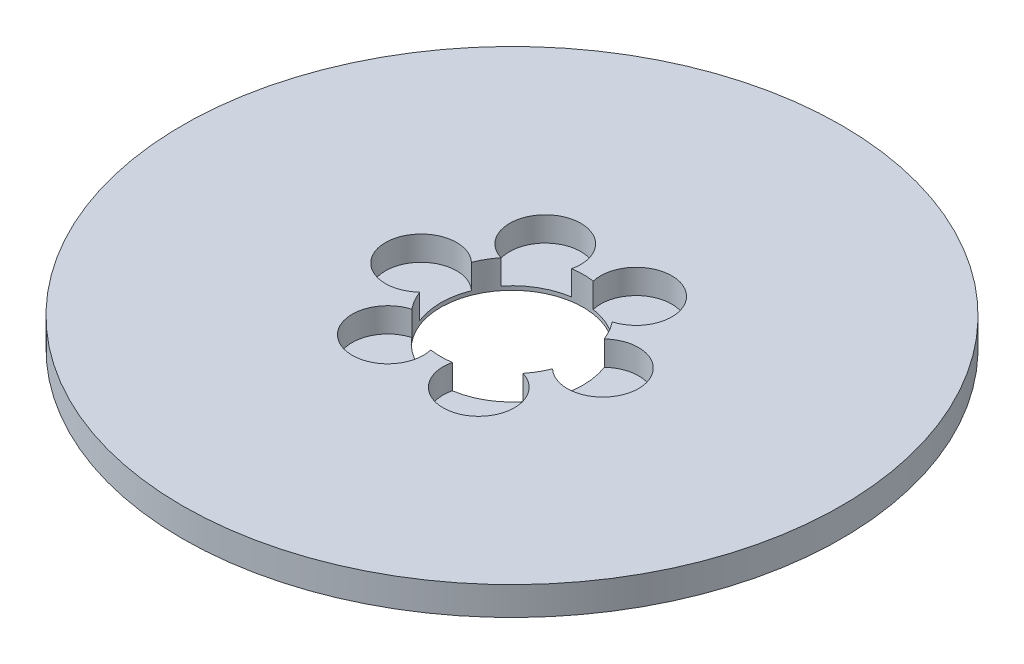
ISO-10303-21;
HEADER;
FILE_DESCRIPTION(('STEP AP214'),'2;1');
FILE_NAME('part.step','',(''),(''),'','','');
FILE_SCHEMA(('AUTOMOTIVE_DESIGN { 1 0 10303 214 1 1 1 1 }'));
ENDSEC;
DATA;
#1=APPLICATION_CONTEXT('core data for automotive mechanical design processes');
#2=APPLICATION_PROTOCOL_DEFINITION('international standard','automotive_design',2000,#1);
#3=PRODUCT_CONTEXT('',#1,'mechanical');
#4=PRODUCT('Part','Part','',(#3));
#5=PRODUCT_RELATED_PRODUCT_CATEGORY('part','',(#4));
#6=PRODUCT_DEFINITION_FORMATION('','',#4);
#7=PRODUCT_DEFINITION_CONTEXT('part definition',#1,'design');
#8=PRODUCT_DEFINITION('design','',#6,#7);
#9=PRODUCT_DEFINITION_SHAPE('','',#8);
#10=(LENGTH_UNIT() NAMED_UNIT(*) SI_UNIT(.MILLI.,.METRE.));
#11=(NAMED_UNIT(*) PLANE_ANGLE_UNIT() SI_UNIT($,.RADIAN.));
#12=(NAMED_UNIT(*) SI_UNIT($,.STERADIAN.) SOLID_ANGLE_UNIT());
#13=UNCERTAINTY_MEASURE_WITH_UNIT(LENGTH_MEASURE(1.E-05),#10,'distance_accuracy_value','');
#14=(GEOMETRIC_REPRESENTATION_CONTEXT(3) GLOBAL_UNCERTAINTY_ASSIGNED_CONTEXT((#13)) GLOBAL_UNIT_ASSIGNED_CONTEXT((#10,
#11,#12)) REPRESENTATION_CONTEXT('',''));
#15=CARTESIAN_POINT('',(0.,0.,0.));
#16=DIRECTION('',(0.,0.,1.));
#17=DIRECTION('',(1.,0.,0.));
#18=AXIS2_PLACEMENT_3D('',#15,#16,#17);
#19=CARTESIAN_POINT('',(0.,8.,0.));
#20=DIRECTION('',(0.,-1.,0.));
#21=DIRECTION('',(0.,0.,-1.));
#22=AXIS2_PLACEMENT_3D('',#19,#20,#21);
#23=CYLINDRICAL_SURFACE('',#22,92.5);
#24=CARTESIAN_POINT('',(0.,8.,0.));
#25=DIRECTION('',(0.,1.,0.));
#26=DIRECTION('',(0.,0.,1.));
#27=AXIS2_PLACEMENT_3D('',#24,#25,#26);
#28=CIRCLE('',#27,92.5);
#29=CARTESIAN_POINT('',(0.,8.,92.5));
#30=VERTEX_POINT('',#29);
#31=EDGE_CURVE('E171',#30,#30,#28,.T.);
#32=ORIENTED_EDGE('',*,*,#31,.F.);
#33=EDGE_LOOP('',(#32));
#34=FACE_BOUND('',#33,.T.);
#35=CARTESIAN_POINT('',(0.,0.,0.));
#36=DIRECTION('',(0.,1.,0.));
#37=DIRECTION('',(0.,0.,1.));
#38=AXIS2_PLACEMENT_3D('',#35,#36,#37);
#39=CIRCLE('',#38,92.5);
#40=CARTESIAN_POINT('',(0.,0.,92.5));
#41=VERTEX_POINT('',#40);
#42=EDGE_CURVE('E157',#41,#41,#39,.T.);
#43=ORIENTED_EDGE('',*,*,#42,.T.);
#44=EDGE_LOOP('',(#43));
#45=FACE_BOUND('',#44,.T.);
#46=ADVANCED_FACE('F39',(#34,#45),#23,.T.);
#47=CARTESIAN_POINT('',(0.,8.,0.));
#48=DIRECTION('',(0.,1.,0.));
#49=DIRECTION('',(0.,0.,1.));
#50=AXIS2_PLACEMENT_3D('',#47,#48,#49);
#51=PLANE('',#50);
#52=CARTESIAN_POINT('',(-12.7580548929387,8.,-22.0975992803219));
#53=DIRECTION('',(0.,1.,0.));
#54=DIRECTION('',(-0.866025403784433,0.,0.50000000000001));
#55=AXIS2_PLACEMENT_3D('',#52,#53,#54);
#56=CIRCLE('',#55,10.);
#57=CARTESIAN_POINT('',(-3.03302849575421,8.,-19.768680738581));
#58=VERTEX_POINT('',#57);
#59=CARTESIAN_POINT('',(-15.6036654710384,8.,-12.5110200970154));
#60=VERTEX_POINT('',#59);
#61=EDGE_CURVE('E214',#58,#60,#56,.T.);
#62=ORIENTED_EDGE('',*,*,#61,.F.);
#63=CARTESIAN_POINT('',(0.,8.,0.));
#64=DIRECTION('',(0.,1.,0.));
#65=DIRECTION('',(0.,0.,1.));
#66=AXIS2_PLACEMENT_3D('',#63,#64,#65);
#67=CIRCLE('',#66,20.);
#68=CARTESIAN_POINT('',(3.0330284957538,8.,-19.7686807385811));
#69=VERTEX_POINT('',#68);
#70=EDGE_CURVE('E272',#69,#58,#67,.T.);
#71=ORIENTED_EDGE('',*,*,#70,.F.);
#72=CARTESIAN_POINT('',(12.7580548929382,8.,-22.0975992803222));
#73=DIRECTION('',(0.,1.,0.));
#74=DIRECTION('',(-0.866025403784443,0.,-0.499999999999992));
#75=AXIS2_PLACEMENT_3D('',#72,#73,#74);
#76=CIRCLE('',#75,10.);
#77=CARTESIAN_POINT('',(15.6036654710382,8.,-12.5110200970157));
#78=VERTEX_POINT('',#77);
#79=EDGE_CURVE('E285',#78,#69,#76,.T.);
#80=ORIENTED_EDGE('',*,*,#79,.F.);
#81=CARTESIAN_POINT('',(18.6366939667923,8.,-7.25766064156546));
#82=VERTEX_POINT('',#81);
#83=EDGE_CURVE('E165',#82,#78,#67,.T.);
#84=ORIENTED_EDGE('',*,*,#83,.F.);
#85=CARTESIAN_POINT('',(25.5161097858769,8.,0.));
#86=DIRECTION('',(0.,1.,0.));
#87=DIRECTION('',(0.,0.,-1.));
#88=AXIS2_PLACEMENT_3D('',#85,#86,#87);
#89=CIRCLE('',#88,10.);
#90=CARTESIAN_POINT('',(18.6366939667923,8.,7.25766064156546));
#91=VERTEX_POINT('',#90);
#92=EDGE_CURVE('E281',#91,#82,#89,.T.);
#93=ORIENTED_EDGE('',*,*,#92,.F.);
#94=CARTESIAN_POINT('',(15.6036654710384,8.,12.5110200970155));
#95=VERTEX_POINT('',#94);
#96=EDGE_CURVE('E160',#95,#91,#67,.T.);
#97=ORIENTED_EDGE('',*,*,#96,.F.);
#98=CARTESIAN_POINT('',(12.7580548929385,8.,22.097599280322));
#99=DIRECTION('',(0.,1.,0.));
#100=DIRECTION('',(0.866025403784436,0.,-0.500000000000004));
#101=AXIS2_PLACEMENT_3D('',#98,#99,#100);
#102=CIRCLE('',#101,10.);
#103=CARTESIAN_POINT('',(3.03302849575407,8.,19.768680738581));
#104=VERTEX_POINT('',#103);
#105=EDGE_CURVE('E154',#104,#95,#102,.T.);
#106=ORIENTED_EDGE('',*,*,#105,.F.);
#107=CARTESIAN_POINT('',(-3.03302849575393,8.,19.768680738581));
#108=VERTEX_POINT('',#107);
#109=EDGE_CURVE('E150',#108,#104,#67,.T.);
#110=ORIENTED_EDGE('',*,*,#109,.F.);
#111=CARTESIAN_POINT('',(-12.7580548929384,8.,22.0975992803221));
#112=DIRECTION('',(0.,1.,0.));
#113=DIRECTION('',(0.86602540378444,0.,0.499999999999998));
#114=AXIS2_PLACEMENT_3D('',#111,#112,#113);
#115=CIRCLE('',#114,10.);
#116=CARTESIAN_POINT('',(-15.6036654710383,8.,12.5110200970156));
#117=VERTEX_POINT('',#116);
#118=EDGE_CURVE('E127',#117,#108,#115,.T.);
#119=ORIENTED_EDGE('',*,*,#118,.F.);
#120=CARTESIAN_POINT('',(-18.6366939667923,8.,7.25766064156546));
#121=VERTEX_POINT('',#120);
#122=EDGE_CURVE('E156',#121,#117,#67,.T.);
#123=ORIENTED_EDGE('',*,*,#122,.F.);
#124=CARTESIAN_POINT('',(-25.5161097858769,8.,0.));
#125=DIRECTION('',(0.,1.,0.));
#126=DIRECTION('',(0.,0.,1.));
#127=AXIS2_PLACEMENT_3D('',#124,#125,#126);
#128=CIRCLE('',#127,10.);
#129=CARTESIAN_POINT('',(-18.6366939667923,8.,-7.25766064156546));
#130=VERTEX_POINT('',#129);
#131=EDGE_CURVE('E164',#130,#121,#128,.T.);
#132=ORIENTED_EDGE('',*,*,#131,.F.);
#133=EDGE_CURVE('E159',#60,#130,#67,.T.);
#134=ORIENTED_EDGE('',*,*,#133,.F.);
#135=EDGE_LOOP('',(#62,#71,#80,#84,#93,#97,#106,#110,#119,#123,#132,#134));
#136=FACE_BOUND('',#135,.T.);
#137=ORIENTED_EDGE('',*,*,#31,.T.);
#138=EDGE_LOOP('',(#137));
#139=FACE_BOUND('',#138,.T.);
#140=ADVANCED_FACE('F155',(#136,#139),#51,.T.);
#141=CARTESIAN_POINT('',(0.,0.,0.));
#142=DIRECTION('',(0.,1.,0.));
#143=DIRECTION('',(0.,0.,1.));
#144=AXIS2_PLACEMENT_3D('',#141,#142,#143);
#145=PLANE('',#144);
#146=CARTESIAN_POINT('',(0.,0.,0.));
#147=DIRECTION('',(0.,1.,0.));
#148=DIRECTION('',(0.,0.,1.));
#149=AXIS2_PLACEMENT_3D('',#146,#147,#148);
#150=CIRCLE('',#149,20.);
#151=CARTESIAN_POINT('',(0.,0.,20.));
#152=VERTEX_POINT('',#151);
#153=EDGE_CURVE('E170',#152,#152,#150,.T.);
#154=ORIENTED_EDGE('',*,*,#153,.T.);
#155=EDGE_LOOP('',(#154));
#156=FACE_BOUND('',#155,.T.);
#157=ORIENTED_EDGE('',*,*,#42,.F.);
#158=EDGE_LOOP('',(#157));
#159=FACE_BOUND('',#158,.T.);
#160=ADVANCED_FACE('F232',(#156,#159),#145,.F.);
#161=CARTESIAN_POINT('',(0.,8.,0.));
#162=DIRECTION('',(0.,-1.,0.));
#163=DIRECTION('',(0.,0.,-1.));
#164=AXIS2_PLACEMENT_3D('',#161,#162,#163);
#165=CYLINDRICAL_SURFACE('',#164,20.);
#166=DIRECTION('',(0.,1.,0.));
#167=VECTOR('',#166,1.);
#168=CARTESIAN_POINT('',(-3.03302849575421,4.55727615114548,-19.768680738581));
#169=LINE('',#168,#167);
#170=CARTESIAN_POINT('',(-3.03302849575421,1.11455230229096,-19.768680738581));
#171=VERTEX_POINT('',#170);
#172=EDGE_CURVE('E11',#171,#58,#169,.T.);
#173=ORIENTED_EDGE('',*,*,#172,.F.);
#174=CARTESIAN_POINT('',(0.,1.11455230229096,0.));
#175=DIRECTION('',(0.,1.,0.));
#176=DIRECTION('',(0.,0.,1.));
#177=AXIS2_PLACEMENT_3D('',#174,#175,#176);
#178=CIRCLE('',#177,20.);
#179=CARTESIAN_POINT('',(-15.6036654710384,1.11455230229096,-12.5110200970154));
#180=VERTEX_POINT('',#179);
#181=EDGE_CURVE('E209',#171,#180,#178,.T.);
#182=ORIENTED_EDGE('',*,*,#181,.T.);
#183=DIRECTION('',(0.,1.,0.));
#184=VECTOR('',#183,1.);
#185=CARTESIAN_POINT('',(-15.6036654710384,4.55727615114548,-12.5110200970154));
#186=LINE('',#185,#184);
#187=EDGE_CURVE('E46',#60,#180,#186,.F.);
#188=ORIENTED_EDGE('',*,*,#187,.F.);
#189=ORIENTED_EDGE('',*,*,#133,.T.);
#190=DIRECTION('',(0.,1.,0.));
#191=VECTOR('',#190,1.);
#192=CARTESIAN_POINT('',(-18.6366939667923,4.55727615114548,-7.25766064156546));
#193=LINE('',#192,#191);
#194=CARTESIAN_POINT('',(-18.6366939667923,1.11455230229096,-7.25766064156546));
#195=VERTEX_POINT('',#194);
#196=EDGE_CURVE('E185',#195,#130,#193,.T.);
#197=ORIENTED_EDGE('',*,*,#196,.F.);
#198=CARTESIAN_POINT('',(0.,1.11455230229096,0.));
#199=DIRECTION('',(0.,1.,0.));
#200=DIRECTION('',(0.,0.,1.));
#201=AXIS2_PLACEMENT_3D('',#198,#199,#200);
#202=CIRCLE('',#201,20.);
#203=CARTESIAN_POINT('',(-18.6366939667923,1.11455230229096,7.25766064156546));
#204=VERTEX_POINT('',#203);
#205=EDGE_CURVE('E173',#195,#204,#202,.T.);
#206=ORIENTED_EDGE('',*,*,#205,.T.);
#207=DIRECTION('',(0.,1.,0.));
#208=VECTOR('',#207,1.);
#209=CARTESIAN_POINT('',(-18.6366939667923,4.55727615114548,7.25766064156546));
#210=LINE('',#209,#208);
#211=EDGE_CURVE('E178',#121,#204,#210,.F.);
#212=ORIENTED_EDGE('',*,*,#211,.F.);
#213=ORIENTED_EDGE('',*,*,#122,.T.);
#214=DIRECTION('',(0.,1.,0.));
#215=VECTOR('',#214,1.);
#216=CARTESIAN_POINT('',(-15.6036654710383,4.55727615114548,12.5110200970156));
#217=LINE('',#216,#215);
#218=CARTESIAN_POINT('',(-15.6036654710383,1.11455230229096,12.5110200970156));
#219=VERTEX_POINT('',#218);
#220=EDGE_CURVE('E132',#219,#117,#217,.T.);
#221=ORIENTED_EDGE('',*,*,#220,.F.);
#222=CARTESIAN_POINT('',(0.,1.11455230229096,0.));
#223=DIRECTION('',(0.,1.,0.));
#224=DIRECTION('',(0.,0.,1.));
#225=AXIS2_PLACEMENT_3D('',#222,#223,#224);
#226=CIRCLE('',#225,20.);
#227=CARTESIAN_POINT('',(-3.03302849575393,1.11455230229096,19.768680738581));
#228=VERTEX_POINT('',#227);
#229=EDGE_CURVE('E146',#219,#228,#226,.T.);
#230=ORIENTED_EDGE('',*,*,#229,.T.);
#231=DIRECTION('',(0.,1.,0.));
#232=VECTOR('',#231,1.);
#233=CARTESIAN_POINT('',(-3.03302849575393,4.55727615114548,19.768680738581));
#234=LINE('',#233,#232);
#235=EDGE_CURVE('E128',#108,#228,#234,.F.);
#236=ORIENTED_EDGE('',*,*,#235,.F.);
#237=ORIENTED_EDGE('',*,*,#109,.T.);
#238=DIRECTION('',(0.,1.,0.));
#239=VECTOR('',#238,1.);
#240=CARTESIAN_POINT('',(3.03302849575407,4.55727615114548,19.768680738581));
#241=LINE('',#240,#239);
#242=CARTESIAN_POINT('',(3.03302849575407,1.11455230229096,19.768680738581));
#243=VERTEX_POINT('',#242);
#244=EDGE_CURVE('E192',#243,#104,#241,.T.);
#245=ORIENTED_EDGE('',*,*,#244,.F.);
#246=CARTESIAN_POINT('',(0.,1.11455230229096,0.));
#247=DIRECTION('',(0.,1.,0.));
#248=DIRECTION('',(0.,0.,1.));
#249=AXIS2_PLACEMENT_3D('',#246,#247,#248);
#250=CIRCLE('',#249,20.);
#251=CARTESIAN_POINT('',(15.6036654710384,1.11455230229096,12.5110200970155));
#252=VERTEX_POINT('',#251);
#253=EDGE_CURVE('E190',#243,#252,#250,.T.);
#254=ORIENTED_EDGE('',*,*,#253,.T.);
#255=DIRECTION('',(0.,1.,0.));
#256=VECTOR('',#255,1.);
#257=CARTESIAN_POINT('',(15.6036654710384,4.55727615114548,12.5110200970155));
#258=LINE('',#257,#256);
#259=EDGE_CURVE('E189',#95,#252,#258,.F.);
#260=ORIENTED_EDGE('',*,*,#259,.F.);
#261=ORIENTED_EDGE('',*,*,#96,.T.);
#262=DIRECTION('',(0.,1.,0.));
#263=VECTOR('',#262,1.);
#264=CARTESIAN_POINT('',(18.6366939667923,4.55727615114548,7.25766064156546));
#265=LINE('',#264,#263);
#266=CARTESIAN_POINT('',(18.6366939667923,1.11455230229096,7.25766064156546));
#267=VERTEX_POINT('',#266);
#268=EDGE_CURVE('E203',#267,#91,#265,.T.);
#269=ORIENTED_EDGE('',*,*,#268,.F.);
#270=CARTESIAN_POINT('',(0.,1.11455230229096,0.));
#271=DIRECTION('',(0.,1.,0.));
#272=DIRECTION('',(0.,0.,1.));
#273=AXIS2_PLACEMENT_3D('',#270,#271,#272);
#274=CIRCLE('',#273,20.);
#275=CARTESIAN_POINT('',(18.6366939667923,1.11455230229096,-7.25766064156546));
#276=VERTEX_POINT('',#275);
#277=EDGE_CURVE('E194',#267,#276,#274,.T.);
#278=ORIENTED_EDGE('',*,*,#277,.T.);
#279=DIRECTION('',(0.,1.,0.));
#280=VECTOR('',#279,1.);
#281=CARTESIAN_POINT('',(18.6366939667923,4.55727615114548,-7.25766064156546));
#282=LINE('',#281,#280);
#283=EDGE_CURVE('E196',#82,#276,#282,.F.);
#284=ORIENTED_EDGE('',*,*,#283,.F.);
#285=ORIENTED_EDGE('',*,*,#83,.T.);
#286=DIRECTION('',(0.,1.,0.));
#287=VECTOR('',#286,1.);
#288=CARTESIAN_POINT('',(15.6036654710382,4.55727615114548,-12.5110200970157));
#289=LINE('',#288,#287);
#290=CARTESIAN_POINT('',(15.6036654710382,1.11455230229096,-12.5110200970157));
#291=VERTEX_POINT('',#290);
#292=EDGE_CURVE('E208',#291,#78,#289,.T.);
#293=ORIENTED_EDGE('',*,*,#292,.F.);
#294=CARTESIAN_POINT('',(0.,1.11455230229096,0.));
#295=DIRECTION('',(0.,1.,0.));
#296=DIRECTION('',(0.,0.,1.));
#297=AXIS2_PLACEMENT_3D('',#294,#295,#296);
#298=CIRCLE('',#297,20.);
#299=CARTESIAN_POINT('',(3.0330284957538,1.11455230229096,-19.7686807385811));
#300=VERTEX_POINT('',#299);
#301=EDGE_CURVE('E201',#291,#300,#298,.T.);
#302=ORIENTED_EDGE('',*,*,#301,.T.);
#303=DIRECTION('',(0.,1.,0.));
#304=VECTOR('',#303,1.);
#305=CARTESIAN_POINT('',(3.0330284957538,4.55727615114548,-19.7686807385811));
#306=LINE('',#305,#304);
#307=EDGE_CURVE('E206',#69,#300,#306,.F.);
#308=ORIENTED_EDGE('',*,*,#307,.F.);
#309=ORIENTED_EDGE('',*,*,#70,.T.);
#310=EDGE_LOOP('',(#173,#182,#188,#189,#197,#206,#212,#213,#221,#230,#236,#237,#245,#254,#260,
#261,#269,#278,#284,#285,#293,#302,#308,#309));
#311=FACE_BOUND('',#310,.T.);
#312=ORIENTED_EDGE('',*,*,#153,.F.);
#313=EDGE_LOOP('',(#312));
#314=FACE_BOUND('',#313,.T.);
#315=ADVANCED_FACE('F145',(#311,#314),#165,.F.);
#316=CARTESIAN_POINT('',(-25.5161097858769,1.11455230229096,0.));
#317=DIRECTION('',(0.,1.,0.));
#318=DIRECTION('',(0.,0.,1.));
#319=AXIS2_PLACEMENT_3D('',#316,#317,#318);
#320=CYLINDRICAL_SURFACE('',#319,10.);
#321=ORIENTED_EDGE('',*,*,#196,.T.);
#322=ORIENTED_EDGE('',*,*,#131,.T.);
#323=ORIENTED_EDGE('',*,*,#211,.T.);
#324=CARTESIAN_POINT('',(-25.5161097858769,1.11455230229096,0.));
#325=DIRECTION('',(0.,1.,0.));
#326=DIRECTION('',(0.,0.,1.));
#327=AXIS2_PLACEMENT_3D('',#324,#325,#326);
#328=CIRCLE('',#327,10.);
#329=EDGE_CURVE('E168',#195,#204,#328,.T.);
#330=ORIENTED_EDGE('',*,*,#329,.F.);
#331=EDGE_LOOP('',(#321,#322,#323,#330));
#332=FACE_BOUND('',#331,.T.);
#333=ADVANCED_FACE('F243',(#332),#320,.F.);
#334=CARTESIAN_POINT('',(-25.5161097858769,1.11455230229096,0.));
#335=DIRECTION('',(0.,1.,0.));
#336=DIRECTION('',(0.,0.,1.));
#337=AXIS2_PLACEMENT_3D('',#334,#335,#336);
#338=PLANE('',#337);
#339=ORIENTED_EDGE('',*,*,#329,.T.);
#340=ORIENTED_EDGE('',*,*,#205,.F.);
#341=EDGE_LOOP('',(#339,#340));
#342=FACE_BOUND('',#341,.T.);
#343=ADVANCED_FACE('F247',(#342),#338,.T.);
#344=CARTESIAN_POINT('',(-12.7580548929384,1.11455230229096,22.0975992803221));
#345=DIRECTION('',(0.,1.,0.));
#346=DIRECTION('',(0.,0.,1.));
#347=AXIS2_PLACEMENT_3D('',#344,#345,#346);
#348=CYLINDRICAL_SURFACE('',#347,10.);
#349=ORIENTED_EDGE('',*,*,#220,.T.);
#350=ORIENTED_EDGE('',*,*,#118,.T.);
#351=ORIENTED_EDGE('',*,*,#235,.T.);
#352=CARTESIAN_POINT('',(-12.7580548929384,1.11455230229096,22.0975992803221));
#353=DIRECTION('',(0.,1.,0.));
#354=DIRECTION('',(0.86602540378444,0.,0.499999999999998));
#355=AXIS2_PLACEMENT_3D('',#352,#353,#354);
#356=CIRCLE('',#355,10.);
#357=EDGE_CURVE('E137',#219,#228,#356,.T.);
#358=ORIENTED_EDGE('',*,*,#357,.F.);
#359=EDGE_LOOP('',(#349,#350,#351,#358));
#360=FACE_BOUND('',#359,.T.);
#361=ADVANCED_FACE('F126',(#360),#348,.F.);
#362=CARTESIAN_POINT('',(-12.7580548929384,1.11455230229096,22.0975992803221));
#363=DIRECTION('',(0.,1.,0.));
#364=DIRECTION('',(0.86602540378444,0.,0.499999999999998));
#365=AXIS2_PLACEMENT_3D('',#362,#363,#364);
#366=PLANE('',#365);
#367=ORIENTED_EDGE('',*,*,#357,.T.);
#368=ORIENTED_EDGE('',*,*,#229,.F.);
#369=EDGE_LOOP('',(#367,#368));
#370=FACE_BOUND('',#369,.T.);
#371=ADVANCED_FACE('F254',(#370),#366,.T.);
#372=CARTESIAN_POINT('',(12.7580548929385,1.11455230229096,22.097599280322));
#373=DIRECTION('',(0.,1.,0.));
#374=DIRECTION('',(0.,0.,1.));
#375=AXIS2_PLACEMENT_3D('',#372,#373,#374);
#376=CYLINDRICAL_SURFACE('',#375,10.);
#377=ORIENTED_EDGE('',*,*,#244,.T.);
#378=ORIENTED_EDGE('',*,*,#105,.T.);
#379=ORIENTED_EDGE('',*,*,#259,.T.);
#380=CARTESIAN_POINT('',(12.7580548929385,1.11455230229096,22.097599280322));
#381=DIRECTION('',(0.,1.,0.));
#382=DIRECTION('',(0.866025403784436,0.,-0.500000000000004));
#383=AXIS2_PLACEMENT_3D('',#380,#381,#382);
#384=CIRCLE('',#383,10.);
#385=EDGE_CURVE('E138',#243,#252,#384,.T.);
#386=ORIENTED_EDGE('',*,*,#385,.F.);
#387=EDGE_LOOP('',(#377,#378,#379,#386));
#388=FACE_BOUND('',#387,.T.);
#389=ADVANCED_FACE('F260',(#388),#376,.F.);
#390=CARTESIAN_POINT('',(12.7580548929385,1.11455230229096,22.097599280322));
#391=DIRECTION('',(0.,1.,0.));
#392=DIRECTION('',(0.866025403784436,0.,-0.500000000000004));
#393=AXIS2_PLACEMENT_3D('',#390,#391,#392);
#394=PLANE('',#393);
#395=ORIENTED_EDGE('',*,*,#385,.T.);
#396=ORIENTED_EDGE('',*,*,#253,.F.);
#397=EDGE_LOOP('',(#395,#396));
#398=FACE_BOUND('',#397,.T.);
#399=ADVANCED_FACE('F265',(#398),#394,.T.);
#400=CARTESIAN_POINT('',(25.5161097858769,1.11455230229096,0.));
#401=DIRECTION('',(0.,1.,0.));
#402=DIRECTION('',(0.,0.,1.));
#403=AXIS2_PLACEMENT_3D('',#400,#401,#402);
#404=CYLINDRICAL_SURFACE('',#403,10.);
#405=ORIENTED_EDGE('',*,*,#268,.T.);
#406=ORIENTED_EDGE('',*,*,#92,.T.);
#407=ORIENTED_EDGE('',*,*,#283,.T.);
#408=CARTESIAN_POINT('',(25.5161097858769,1.11455230229096,0.));
#409=DIRECTION('',(0.,1.,0.));
#410=DIRECTION('',(0.,0.,-1.));
#411=AXIS2_PLACEMENT_3D('',#408,#409,#410);
#412=CIRCLE('',#411,10.);
#413=EDGE_CURVE('E287',#267,#276,#412,.T.);
#414=ORIENTED_EDGE('',*,*,#413,.F.);
#415=EDGE_LOOP('',(#405,#406,#407,#414));
#416=FACE_BOUND('',#415,.T.);
#417=ADVANCED_FACE('F300',(#416),#404,.F.);
#418=CARTESIAN_POINT('',(25.5161097858769,1.11455230229096,0.));
#419=DIRECTION('',(0.,1.,0.));
#420=DIRECTION('',(0.,0.,-1.));
#421=AXIS2_PLACEMENT_3D('',#418,#419,#420);
#422=PLANE('',#421);
#423=ORIENTED_EDGE('',*,*,#413,.T.);
#424=ORIENTED_EDGE('',*,*,#277,.F.);
#425=EDGE_LOOP('',(#423,#424));
#426=FACE_BOUND('',#425,.T.);
#427=ADVANCED_FACE('F298',(#426),#422,.T.);
#428=CARTESIAN_POINT('',(12.7580548929382,1.11455230229096,-22.0975992803222));
#429=DIRECTION('',(0.,1.,0.));
#430=DIRECTION('',(0.,0.,1.));
#431=AXIS2_PLACEMENT_3D('',#428,#429,#430);
#432=CYLINDRICAL_SURFACE('',#431,10.);
#433=ORIENTED_EDGE('',*,*,#292,.T.);
#434=ORIENTED_EDGE('',*,*,#79,.T.);
#435=ORIENTED_EDGE('',*,*,#307,.T.);
#436=CARTESIAN_POINT('',(12.7580548929382,1.11455230229096,-22.0975992803222));
#437=DIRECTION('',(0.,1.,0.));
#438=DIRECTION('',(-0.866025403784443,0.,-0.499999999999992));
#439=AXIS2_PLACEMENT_3D('',#436,#437,#438);
#440=CIRCLE('',#439,10.);
#441=EDGE_CURVE('E56',#291,#300,#440,.T.);
#442=ORIENTED_EDGE('',*,*,#441,.F.);
#443=EDGE_LOOP('',(#433,#434,#435,#442));
#444=FACE_BOUND('',#443,.T.);
#445=ADVANCED_FACE('F301',(#444),#432,.F.);
#446=CARTESIAN_POINT('',(12.7580548929382,1.11455230229096,-22.0975992803222));
#447=DIRECTION('',(0.,1.,0.));
#448=DIRECTION('',(-0.866025403784443,0.,-0.499999999999992));
#449=AXIS2_PLACEMENT_3D('',#446,#447,#448);
#450=PLANE('',#449);
#451=ORIENTED_EDGE('',*,*,#441,.T.);
#452=ORIENTED_EDGE('',*,*,#301,.F.);
#453=EDGE_LOOP('',(#451,#452));
#454=FACE_BOUND('',#453,.T.);
#455=ADVANCED_FACE('F221',(#454),#450,.T.);
#456=CARTESIAN_POINT('',(-12.7580548929387,1.11455230229096,-22.0975992803219));
#457=DIRECTION('',(0.,1.,0.));
#458=DIRECTION('',(0.,0.,1.));
#459=AXIS2_PLACEMENT_3D('',#456,#457,#458);
#460=CYLINDRICAL_SURFACE('',#459,10.);
#461=ORIENTED_EDGE('',*,*,#172,.T.);
#462=ORIENTED_EDGE('',*,*,#61,.T.);
#463=ORIENTED_EDGE('',*,*,#187,.T.);
#464=CARTESIAN_POINT('',(-12.7580548929387,1.11455230229096,-22.0975992803219));
#465=DIRECTION('',(0.,1.,0.));
#466=DIRECTION('',(-0.866025403784433,0.,0.50000000000001));
#467=AXIS2_PLACEMENT_3D('',#464,#465,#466);
#468=CIRCLE('',#467,10.);
#469=EDGE_CURVE('E55',#171,#180,#468,.T.);
#470=ORIENTED_EDGE('',*,*,#469,.F.);
#471=EDGE_LOOP('',(#461,#462,#463,#470));
#472=FACE_BOUND('',#471,.T.);
#473=ADVANCED_FACE('F212',(#472),#460,.F.);
#474=CARTESIAN_POINT('',(-12.7580548929387,1.11455230229096,-22.0975992803219));
#475=DIRECTION('',(0.,1.,0.));
#476=DIRECTION('',(-0.866025403784433,0.,0.50000000000001));
#477=AXIS2_PLACEMENT_3D('',#474,#475,#476);
#478=PLANE('',#477);
#479=ORIENTED_EDGE('',*,*,#469,.T.);
#480=ORIENTED_EDGE('',*,*,#181,.F.);
#481=EDGE_LOOP('',(#479,#480));
#482=FACE_BOUND('',#481,.T.);
#483=ADVANCED_FACE('F217',(#482),#478,.T.);
#484=CLOSED_SHELL('',(#46,#140,#160,#315,#333,#343,#361,#371,#389,#399,#417,#427,#445,#455,#473,#483));
#485=MANIFOLD_SOLID_BREP('B2',#484);
#486=ADVANCED_BREP_SHAPE_REPRESENTATION('',(#18,#485),#14);
#487=SHAPE_DEFINITION_REPRESENTATION(#9,#486);
ENDSEC;
END-ISO-10303-21;
